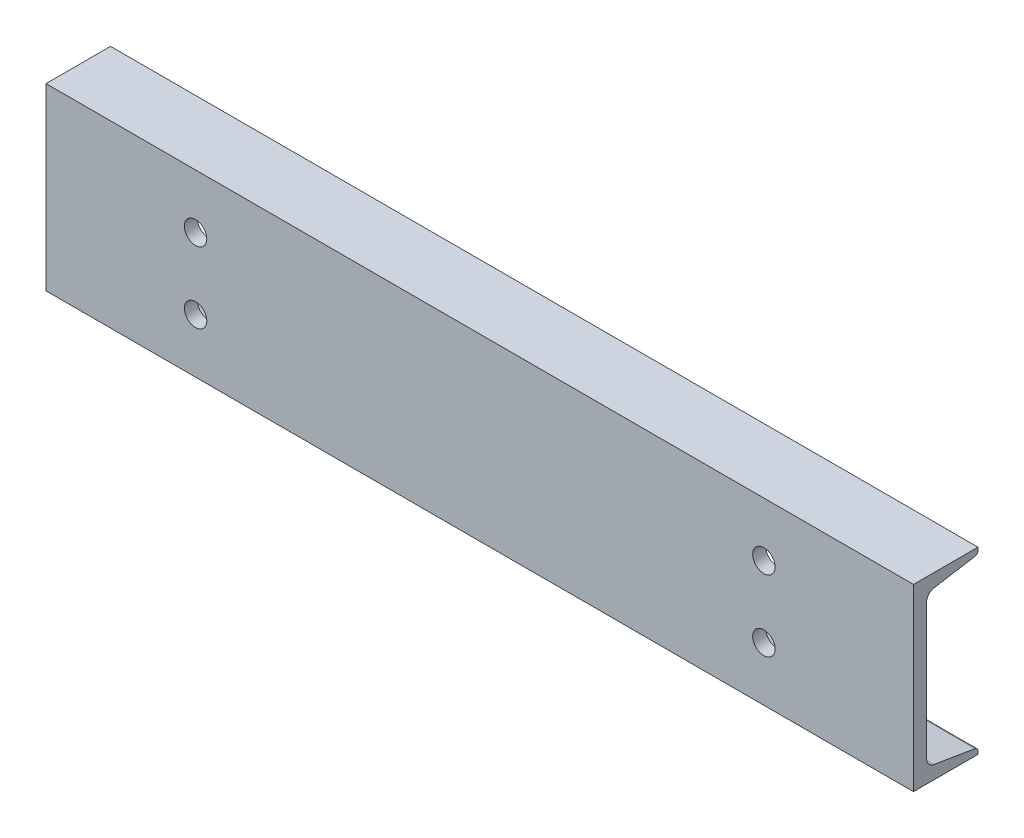
ISO-10303-21;
HEADER;
FILE_DESCRIPTION(('STEP AP214'),'2;1');
FILE_NAME('part.step','',(''),(''),'','','');
FILE_SCHEMA(('AUTOMOTIVE_DESIGN { 1 0 10303 214 1 1 1 1 }'));
ENDSEC;
DATA;
#1=APPLICATION_CONTEXT('core data for automotive mechanical design processes');
#2=APPLICATION_PROTOCOL_DEFINITION('international standard','automotive_design',2000,#1);
#3=PRODUCT_CONTEXT('',#1,'mechanical');
#4=PRODUCT('Part','Part','',(#3));
#5=PRODUCT_RELATED_PRODUCT_CATEGORY('part','',(#4));
#6=PRODUCT_DEFINITION_FORMATION('','',#4);
#7=PRODUCT_DEFINITION_CONTEXT('part definition',#1,'design');
#8=PRODUCT_DEFINITION('design','',#6,#7);
#9=PRODUCT_DEFINITION_SHAPE('','',#8);
#10=(LENGTH_UNIT() NAMED_UNIT(*) SI_UNIT(.MILLI.,.METRE.));
#11=(NAMED_UNIT(*) PLANE_ANGLE_UNIT() SI_UNIT($,.RADIAN.));
#12=(NAMED_UNIT(*) SI_UNIT($,.STERADIAN.) SOLID_ANGLE_UNIT());
#13=UNCERTAINTY_MEASURE_WITH_UNIT(LENGTH_MEASURE(1.E-05),#10,'distance_accuracy_value','');
#14=(GEOMETRIC_REPRESENTATION_CONTEXT(3) GLOBAL_UNCERTAINTY_ASSIGNED_CONTEXT((#13)) GLOBAL_UNIT_ASSIGNED_CONTEXT((#10,
#11,#12)) REPRESENTATION_CONTEXT('',''));
#15=CARTESIAN_POINT('',(0.,0.,0.));
#16=DIRECTION('',(0.,0.,1.));
#17=DIRECTION('',(1.,0.,0.));
#18=AXIS2_PLACEMENT_3D('',#15,#16,#17);
#19=CARTESIAN_POINT('',(368.3,-76.2,27.3939));
#20=DIRECTION('',(0.,1.,0.));
#21=DIRECTION('',(0.,0.,1.));
#22=AXIS2_PLACEMENT_3D('',#19,#20,#21);
#23=PLANE('',#22);
#24=CARTESIAN_POINT('',(-330.2,-76.2,-7.53109999999995));
#25=DIRECTION('',(0.,-1.,0.));
#26=DIRECTION('',(0.,0.,1.));
#27=AXIS2_PLACEMENT_3D('',#24,#25,#26);
#28=CIRCLE('',#27,9.52500000000002);
#29=CARTESIAN_POINT('',(-330.2,-76.2,1.99390000000007));
#30=VERTEX_POINT('',#29);
#31=EDGE_CURVE('E274',#30,#30,#28,.T.);
#32=ORIENTED_EDGE('',*,*,#31,.F.);
#33=EDGE_LOOP('',(#32));
#34=FACE_BOUND('',#33,.T.);
#35=CARTESIAN_POINT('',(330.2,-76.2,-7.53109999999995));
#36=DIRECTION('',(0.,-1.,0.));
#37=DIRECTION('',(0.,0.,-1.));
#38=AXIS2_PLACEMENT_3D('',#35,#36,#37);
#39=CIRCLE('',#38,9.52500000000002);
#40=CARTESIAN_POINT('',(330.2,-76.2,-17.0561));
#41=VERTEX_POINT('',#40);
#42=EDGE_CURVE('E278',#41,#41,#39,.T.);
#43=ORIENTED_EDGE('',*,*,#42,.F.);
#44=EDGE_LOOP('',(#43));
#45=FACE_BOUND('',#44,.T.);
#46=CARTESIAN_POINT('',(-190.5,-76.2,-7.53109999999995));
#47=DIRECTION('',(0.,-1.,0.));
#48=DIRECTION('',(0.,0.,1.));
#49=AXIS2_PLACEMENT_3D('',#46,#47,#48);
#50=CIRCLE('',#49,9.525);
#51=CARTESIAN_POINT('',(-190.5,-76.2,1.99390000000004));
#52=VERTEX_POINT('',#51);
#53=EDGE_CURVE('E282',#52,#52,#50,.T.);
#54=ORIENTED_EDGE('',*,*,#53,.F.);
#55=EDGE_LOOP('',(#54));
#56=FACE_BOUND('',#55,.T.);
#57=CARTESIAN_POINT('',(190.5,-76.2,-7.53109999999995));
#58=DIRECTION('',(0.,-1.,0.));
#59=DIRECTION('',(0.,0.,-1.));
#60=AXIS2_PLACEMENT_3D('',#57,#58,#59);
#61=CIRCLE('',#60,9.525);
#62=CARTESIAN_POINT('',(190.5,-76.2,-17.0560999999999));
#63=VERTEX_POINT('',#62);
#64=EDGE_CURVE('E285',#63,#63,#61,.T.);
#65=ORIENTED_EDGE('',*,*,#64,.F.);
#66=EDGE_LOOP('',(#65));
#67=FACE_BOUND('',#66,.T.);
#68=DIRECTION('',(0.,0.,-1.));
#69=VECTOR('',#68,1.);
#70=CARTESIAN_POINT('',(-368.3,-76.2,27.3939));
#71=LINE('',#70,#69);
#72=CARTESIAN_POINT('',(-368.3,-76.2,27.3939));
#73=VERTEX_POINT('',#72);
#74=CARTESIAN_POINT('',(-368.3,-76.2,-27.3939));
#75=VERTEX_POINT('',#74);
#76=EDGE_CURVE('E162',#73,#75,#71,.T.);
#77=ORIENTED_EDGE('',*,*,#76,.T.);
#78=DIRECTION('',(-1.,0.,0.));
#79=VECTOR('',#78,1.);
#80=CARTESIAN_POINT('',(368.3,-76.2,-27.3939));
#81=LINE('',#80,#79);
#82=CARTESIAN_POINT('',(368.3,-76.2,-27.3939));
#83=VERTEX_POINT('',#82);
#84=EDGE_CURVE('E11',#83,#75,#81,.T.);
#85=ORIENTED_EDGE('',*,*,#84,.F.);
#86=DIRECTION('',(0.,0.,-1.));
#87=VECTOR('',#86,1.);
#88=CARTESIAN_POINT('',(368.3,-76.2,27.3939));
#89=LINE('',#88,#87);
#90=CARTESIAN_POINT('',(368.3,-76.2,27.3939));
#91=VERTEX_POINT('',#90);
#92=EDGE_CURVE('E185',#91,#83,#89,.T.);
#93=ORIENTED_EDGE('',*,*,#92,.F.);
#94=DIRECTION('',(-1.,0.,0.));
#95=VECTOR('',#94,1.);
#96=CARTESIAN_POINT('',(368.3,-76.2,27.3939));
#97=LINE('',#96,#95);
#98=EDGE_CURVE('E158',#91,#73,#97,.T.);
#99=ORIENTED_EDGE('',*,*,#98,.T.);
#100=EDGE_LOOP('',(#77,#85,#93,#99));
#101=FACE_BOUND('',#100,.T.);
#102=ADVANCED_FACE('F42',(#34,#45,#56,#67,#101),#23,.F.);
#103=CARTESIAN_POINT('',(368.3,-76.2,-27.3939));
#104=DIRECTION('',(0.,0.,1.));
#105=DIRECTION('',(1.,0.,0.));
#106=AXIS2_PLACEMENT_3D('',#103,#104,#105);
#107=PLANE('',#106);
#108=DIRECTION('',(0.,1.,0.));
#109=VECTOR('',#108,1.);
#110=CARTESIAN_POINT('',(-368.3,-76.2,-27.3939));
#111=LINE('',#110,#109);
#112=CARTESIAN_POINT('',(-368.3,-73.7107446530364,-27.3939));
#113=VERTEX_POINT('',#112);
#114=EDGE_CURVE('E165',#75,#113,#111,.T.);
#115=ORIENTED_EDGE('',*,*,#114,.T.);
#116=DIRECTION('',(-1.,0.,0.));
#117=VECTOR('',#116,1.);
#118=CARTESIAN_POINT('',(368.3,-73.7107446530364,-27.3939));
#119=LINE('',#118,#117);
#120=CARTESIAN_POINT('',(368.3,-73.7107446530364,-27.3939));
#121=VERTEX_POINT('',#120);
#122=EDGE_CURVE('E50',#121,#113,#119,.T.);
#123=ORIENTED_EDGE('',*,*,#122,.F.);
#124=DIRECTION('',(0.,1.,0.));
#125=VECTOR('',#124,1.);
#126=CARTESIAN_POINT('',(368.3,-76.2,-27.3939));
#127=LINE('',#126,#125);
#128=EDGE_CURVE('E113',#83,#121,#127,.T.);
#129=ORIENTED_EDGE('',*,*,#128,.F.);
#130=ORIENTED_EDGE('',*,*,#84,.T.);
#131=EDGE_LOOP('',(#115,#123,#129,#130));
#132=FACE_BOUND('',#131,.T.);
#133=ADVANCED_FACE('F266',(#132),#107,.F.);
#134=CARTESIAN_POINT('',(368.3,-73.7107446530364,-24.3459));
#135=DIRECTION('',(-1.,0.,0.));
#136=DIRECTION('',(0.,0.,1.));
#137=AXIS2_PLACEMENT_3D('',#134,#135,#136);
#138=CYLINDRICAL_SURFACE('',#137,3.04799999999999);
#139=CARTESIAN_POINT('',(-368.3,-73.7107446530364,-24.3459));
#140=DIRECTION('',(1.,0.,0.));
#141=DIRECTION('',(0.,0.,-1.));
#142=AXIS2_PLACEMENT_3D('',#139,#140,#141);
#143=CIRCLE('',#142,3.04799999999999);
#144=CARTESIAN_POINT('',(-368.3,-70.7042219011292,-24.8470236796088));
#145=VERTEX_POINT('',#144);
#146=EDGE_CURVE('E168',#113,#145,#143,.T.);
#147=ORIENTED_EDGE('',*,*,#146,.T.);
#148=DIRECTION('',(-1.,0.,0.));
#149=VECTOR('',#148,1.);
#150=CARTESIAN_POINT('',(368.3,-70.7042219011292,-24.8470236796088));
#151=LINE('',#150,#149);
#152=CARTESIAN_POINT('',(368.3,-70.7042219011292,-24.8470236796088));
#153=VERTEX_POINT('',#152);
#154=EDGE_CURVE('E204',#153,#145,#151,.T.);
#155=ORIENTED_EDGE('',*,*,#154,.F.);
#156=CARTESIAN_POINT('',(368.3,-73.7107446530364,-24.3459));
#157=DIRECTION('',(1.,0.,0.));
#158=DIRECTION('',(0.,0.,-1.));
#159=AXIS2_PLACEMENT_3D('',#156,#157,#158);
#160=CIRCLE('',#159,3.04799999999999);
#161=EDGE_CURVE('E212',#121,#153,#160,.T.);
#162=ORIENTED_EDGE('',*,*,#161,.F.);
#163=ORIENTED_EDGE('',*,*,#122,.T.);
#164=EDGE_LOOP('',(#147,#155,#162,#163));
#165=FACE_BOUND('',#164,.T.);
#166=ADVANCED_FACE('F210',(#165),#138,.T.);
#167=CARTESIAN_POINT('',(368.3,-64.908143628462,9.92690919902199));
#168=DIRECTION('',(0.,-0.986391978972162,0.164410656039631));
#169=DIRECTION('',(0.,-0.164410656039631,-0.986391978972162));
#170=AXIS2_PLACEMENT_3D('',#167,#168,#169);
#171=PLANE('',#170);
#172=CARTESIAN_POINT('',(-330.2,-67.8180240885079,-7.53109999999995));
#173=DIRECTION('',(0.,-0.986391978972162,0.164410656039631));
#174=DIRECTION('',(0.,-0.164410656039631,-0.986391978972162));
#175=AXIS2_PLACEMENT_3D('',#172,#173,#174);
#176=ELLIPSE('',#175,9.65640455625485,9.52500000000002);
#177=CARTESIAN_POINT('',(-330.2,-69.4056398965859,-17.0561));
#178=VERTEX_POINT('',#177);
#179=EDGE_CURVE('E299',#178,#178,#176,.F.);
#180=ORIENTED_EDGE('',*,*,#179,.F.);
#181=EDGE_LOOP('',(#180));
#182=FACE_BOUND('',#181,.T.);
#183=CARTESIAN_POINT('',(330.2,-67.8180240885079,-7.53109999999995));
#184=DIRECTION('',(0.,-0.986391978972162,0.164410656039631));
#185=DIRECTION('',(0.,-0.164410656039631,-0.986391978972162));
#186=AXIS2_PLACEMENT_3D('',#183,#184,#185);
#187=ELLIPSE('',#186,9.65640455625485,9.52500000000002);
#188=CARTESIAN_POINT('',(330.2,-69.4056398965859,-17.0561));
#189=VERTEX_POINT('',#188);
#190=EDGE_CURVE('E296',#189,#189,#187,.F.);
#191=ORIENTED_EDGE('',*,*,#190,.F.);
#192=EDGE_LOOP('',(#191));
#193=FACE_BOUND('',#192,.T.);
#194=CARTESIAN_POINT('',(-190.5,-67.8180240885079,-7.53109999999995));
#195=DIRECTION('',(0.,-0.986391978972162,0.164410656039631));
#196=DIRECTION('',(0.,-0.164410656039631,-0.986391978972162));
#197=AXIS2_PLACEMENT_3D('',#194,#195,#196);
#198=ELLIPSE('',#197,9.65640455625482,9.525);
#199=CARTESIAN_POINT('',(-190.5,-69.4056398965858,-17.0560999999999));
#200=VERTEX_POINT('',#199);
#201=EDGE_CURVE('E287',#200,#200,#198,.F.);
#202=ORIENTED_EDGE('',*,*,#201,.F.);
#203=EDGE_LOOP('',(#202));
#204=FACE_BOUND('',#203,.T.);
#205=CARTESIAN_POINT('',(190.5,-67.8180240885079,-7.53109999999995));
#206=DIRECTION('',(0.,-0.986391978972162,0.164410656039631));
#207=DIRECTION('',(0.,-0.164410656039631,-0.986391978972162));
#208=AXIS2_PLACEMENT_3D('',#205,#206,#207);
#209=ELLIPSE('',#208,9.65640455625482,9.525);
#210=CARTESIAN_POINT('',(190.5,-69.4056398965858,-17.0560999999999));
#211=VERTEX_POINT('',#210);
#212=EDGE_CURVE('E166',#211,#211,#209,.F.);
#213=ORIENTED_EDGE('',*,*,#212,.F.);
#214=EDGE_LOOP('',(#213));
#215=FACE_BOUND('',#214,.T.);
#216=DIRECTION('',(0.,0.164410656039631,0.986391978972162));
#217=VECTOR('',#216,1.);
#218=CARTESIAN_POINT('',(-368.3,-64.908143628462,9.92690919902199));
#219=LINE('',#218,#217);
#220=CARTESIAN_POINT('',(-368.3,-64.908143628462,9.92690919902199));
#221=VERTEX_POINT('',#220);
#222=EDGE_CURVE('E170',#145,#221,#219,.T.);
#223=ORIENTED_EDGE('',*,*,#222,.T.);
#224=DIRECTION('',(-1.,0.,0.));
#225=VECTOR('',#224,1.);
#226=CARTESIAN_POINT('',(368.3,-64.908143628462,9.92690919902199));
#227=LINE('',#226,#225);
#228=CARTESIAN_POINT('',(368.3,-64.908143628462,9.92690919902199));
#229=VERTEX_POINT('',#228);
#230=EDGE_CURVE('E201',#229,#221,#227,.T.);
#231=ORIENTED_EDGE('',*,*,#230,.F.);
#232=DIRECTION('',(0.,0.164410656039631,0.986391978972162));
#233=VECTOR('',#232,1.);
#234=CARTESIAN_POINT('',(368.3,-64.908143628462,9.92690919902199));
#235=LINE('',#234,#233);
#236=EDGE_CURVE('E230',#153,#229,#235,.T.);
#237=ORIENTED_EDGE('',*,*,#236,.F.);
#238=ORIENTED_EDGE('',*,*,#154,.T.);
#239=EDGE_LOOP('',(#223,#231,#237,#238));
#240=FACE_BOUND('',#239,.T.);
#241=ADVANCED_FACE('F221',(#182,#193,#204,#215,#240),#171,.F.);
#242=CARTESIAN_POINT('',(368.3,-57.3918367486941,8.67409999999999));
#243=DIRECTION('',(-1.,0.,0.));
#244=DIRECTION('',(0.,0.,1.));
#245=AXIS2_PLACEMENT_3D('',#242,#243,#244);
#246=CYLINDRICAL_SURFACE('',#245,7.62000000000001);
#247=CARTESIAN_POINT('',(-368.3,-57.3918367486941,8.67409999999999));
#248=DIRECTION('',(-1.,0.,0.));
#249=DIRECTION('',(0.,0.,-1.));
#250=AXIS2_PLACEMENT_3D('',#247,#248,#249);
#251=CIRCLE('',#250,7.62000000000001);
#252=CARTESIAN_POINT('',(-368.3,-57.3918367486941,16.2941));
#253=VERTEX_POINT('',#252);
#254=EDGE_CURVE('E172',#221,#253,#251,.T.);
#255=ORIENTED_EDGE('',*,*,#254,.T.);
#256=DIRECTION('',(-1.,0.,0.));
#257=VECTOR('',#256,1.);
#258=CARTESIAN_POINT('',(368.3,-57.3918367486941,16.2941));
#259=LINE('',#258,#257);
#260=CARTESIAN_POINT('',(368.3,-57.3918367486941,16.2941));
#261=VERTEX_POINT('',#260);
#262=EDGE_CURVE('E198',#261,#253,#259,.T.);
#263=ORIENTED_EDGE('',*,*,#262,.F.);
#264=CARTESIAN_POINT('',(368.3,-57.3918367486941,8.67409999999999));
#265=DIRECTION('',(-1.,0.,0.));
#266=DIRECTION('',(0.,0.,-1.));
#267=AXIS2_PLACEMENT_3D('',#264,#265,#266);
#268=CIRCLE('',#267,7.62000000000001);
#269=EDGE_CURVE('E227',#229,#261,#268,.T.);
#270=ORIENTED_EDGE('',*,*,#269,.F.);
#271=ORIENTED_EDGE('',*,*,#230,.T.);
#272=EDGE_LOOP('',(#255,#263,#270,#271));
#273=FACE_BOUND('',#272,.T.);
#274=ADVANCED_FACE('F225',(#273),#246,.F.);
#275=CARTESIAN_POINT('',(368.3,57.3918367486941,16.2941));
#276=DIRECTION('',(0.,0.,1.));
#277=DIRECTION('',(0.,-1.,0.));
#278=AXIS2_PLACEMENT_3D('',#275,#276,#277);
#279=PLANE('',#278);
#280=CARTESIAN_POINT('',(241.3,30.1625,16.2941));
#281=DIRECTION('',(0.,0.,1.));
#282=DIRECTION('',(0.,-1.,0.));
#283=AXIS2_PLACEMENT_3D('',#280,#281,#282);
#284=CIRCLE('',#283,9.52500000000002);
#285=CARTESIAN_POINT('',(241.3,20.6375,16.2941));
#286=VERTEX_POINT('',#285);
#287=EDGE_CURVE('E323',#286,#286,#284,.F.);
#288=ORIENTED_EDGE('',*,*,#287,.F.);
#289=EDGE_LOOP('',(#288));
#290=FACE_BOUND('',#289,.T.);
#291=CARTESIAN_POINT('',(-241.3,30.1625000000001,16.2941));
#292=DIRECTION('',(0.,0.,1.));
#293=DIRECTION('',(0.,-1.,0.));
#294=AXIS2_PLACEMENT_3D('',#291,#292,#293);
#295=CIRCLE('',#294,9.52500000000002);
#296=CARTESIAN_POINT('',(-241.3,20.6375,16.2941));
#297=VERTEX_POINT('',#296);
#298=EDGE_CURVE('E317',#297,#297,#295,.F.);
#299=ORIENTED_EDGE('',*,*,#298,.F.);
#300=EDGE_LOOP('',(#299));
#301=FACE_BOUND('',#300,.T.);
#302=CARTESIAN_POINT('',(-241.3,-30.1625,16.2941));
#303=DIRECTION('',(0.,0.,1.));
#304=DIRECTION('',(0.,-1.,0.));
#305=AXIS2_PLACEMENT_3D('',#302,#303,#304);
#306=CIRCLE('',#305,9.52500000000002);
#307=CARTESIAN_POINT('',(-241.3,-39.6875000000001,16.2941));
#308=VERTEX_POINT('',#307);
#309=EDGE_CURVE('E311',#308,#308,#306,.F.);
#310=ORIENTED_EDGE('',*,*,#309,.F.);
#311=EDGE_LOOP('',(#310));
#312=FACE_BOUND('',#311,.T.);
#313=CARTESIAN_POINT('',(241.3,-30.1625,16.2941));
#314=DIRECTION('',(0.,0.,1.));
#315=DIRECTION('',(0.,-1.,0.));
#316=AXIS2_PLACEMENT_3D('',#313,#314,#315);
#317=CIRCLE('',#316,9.52500000000002);
#318=CARTESIAN_POINT('',(241.3,-39.6875,16.2941));
#319=VERTEX_POINT('',#318);
#320=EDGE_CURVE('E303',#319,#319,#317,.F.);
#321=ORIENTED_EDGE('',*,*,#320,.F.);
#322=EDGE_LOOP('',(#321));
#323=FACE_BOUND('',#322,.T.);
#324=DIRECTION('',(0.,1.,0.));
#325=VECTOR('',#324,1.);
#326=CARTESIAN_POINT('',(-368.3,57.3918367486941,16.2941));
#327=LINE('',#326,#325);
#328=CARTESIAN_POINT('',(-368.3,57.3918367486941,16.2941));
#329=VERTEX_POINT('',#328);
#330=EDGE_CURVE('E174',#253,#329,#327,.T.);
#331=ORIENTED_EDGE('',*,*,#330,.T.);
#332=DIRECTION('',(-1.,0.,0.));
#333=VECTOR('',#332,1.);
#334=CARTESIAN_POINT('',(368.3,57.3918367486941,16.2941));
#335=LINE('',#334,#333);
#336=CARTESIAN_POINT('',(368.3,57.3918367486941,16.2941));
#337=VERTEX_POINT('',#336);
#338=EDGE_CURVE('E195',#337,#329,#335,.T.);
#339=ORIENTED_EDGE('',*,*,#338,.F.);
#340=DIRECTION('',(0.,1.,0.));
#341=VECTOR('',#340,1.);
#342=CARTESIAN_POINT('',(368.3,57.3918367486941,16.2941));
#343=LINE('',#342,#341);
#344=EDGE_CURVE('E229',#261,#337,#343,.T.);
#345=ORIENTED_EDGE('',*,*,#344,.F.);
#346=ORIENTED_EDGE('',*,*,#262,.T.);
#347=EDGE_LOOP('',(#331,#339,#345,#346));
#348=FACE_BOUND('',#347,.T.);
#349=ADVANCED_FACE('F336',(#290,#301,#312,#323,#348),#279,.F.);
#350=CARTESIAN_POINT('',(368.3,57.3918367486941,8.6741));
#351=DIRECTION('',(-1.,0.,0.));
#352=DIRECTION('',(0.,0.,1.));
#353=AXIS2_PLACEMENT_3D('',#350,#351,#352);
#354=CYLINDRICAL_SURFACE('',#353,7.62000000000001);
#355=CARTESIAN_POINT('',(-368.3,57.3918367486941,8.6741));
#356=DIRECTION('',(-1.,0.,0.));
#357=DIRECTION('',(0.,0.,1.));
#358=AXIS2_PLACEMENT_3D('',#355,#356,#357);
#359=CIRCLE('',#358,7.62000000000001);
#360=CARTESIAN_POINT('',(-368.3,64.908143628462,9.92690919902198));
#361=VERTEX_POINT('',#360);
#362=EDGE_CURVE('E176',#329,#361,#359,.T.);
#363=ORIENTED_EDGE('',*,*,#362,.T.);
#364=DIRECTION('',(-1.,0.,0.));
#365=VECTOR('',#364,1.);
#366=CARTESIAN_POINT('',(368.3,64.908143628462,9.92690919902198));
#367=LINE('',#366,#365);
#368=CARTESIAN_POINT('',(368.3,64.908143628462,9.92690919902198));
#369=VERTEX_POINT('',#368);
#370=EDGE_CURVE('E192',#369,#361,#367,.T.);
#371=ORIENTED_EDGE('',*,*,#370,.F.);
#372=CARTESIAN_POINT('',(368.3,57.3918367486941,8.6741));
#373=DIRECTION('',(-1.,0.,0.));
#374=DIRECTION('',(0.,0.,1.));
#375=AXIS2_PLACEMENT_3D('',#372,#373,#374);
#376=CIRCLE('',#375,7.62000000000001);
#377=EDGE_CURVE('E232',#337,#369,#376,.T.);
#378=ORIENTED_EDGE('',*,*,#377,.F.);
#379=ORIENTED_EDGE('',*,*,#338,.T.);
#380=EDGE_LOOP('',(#363,#371,#378,#379));
#381=FACE_BOUND('',#380,.T.);
#382=ADVANCED_FACE('F339',(#381),#354,.F.);
#383=CARTESIAN_POINT('',(368.3,64.908143628462,9.92690919902198));
#384=DIRECTION('',(0.,0.986391978972162,0.16441065603963));
#385=DIRECTION('',(0.,-0.16441065603963,0.986391978972162));
#386=AXIS2_PLACEMENT_3D('',#383,#384,#385);
#387=PLANE('',#386);
#388=DIRECTION('',(0.,0.16441065603963,-0.986391978972162));
#389=VECTOR('',#388,1.);
#390=CARTESIAN_POINT('',(-368.3,64.908143628462,9.92690919902198));
#391=LINE('',#390,#389);
#392=CARTESIAN_POINT('',(-368.3,70.7042219011292,-24.8470236796088));
#393=VERTEX_POINT('',#392);
#394=EDGE_CURVE('E178',#361,#393,#391,.T.);
#395=ORIENTED_EDGE('',*,*,#394,.T.);
#396=DIRECTION('',(-1.,0.,0.));
#397=VECTOR('',#396,1.);
#398=CARTESIAN_POINT('',(368.3,70.7042219011292,-24.8470236796088));
#399=LINE('',#398,#397);
#400=CARTESIAN_POINT('',(368.3,70.7042219011292,-24.8470236796088));
#401=VERTEX_POINT('',#400);
#402=EDGE_CURVE('E189',#401,#393,#399,.T.);
#403=ORIENTED_EDGE('',*,*,#402,.F.);
#404=DIRECTION('',(0.,0.16441065603963,-0.986391978972162));
#405=VECTOR('',#404,1.);
#406=CARTESIAN_POINT('',(368.3,64.908143628462,9.92690919902198));
#407=LINE('',#406,#405);
#408=EDGE_CURVE('E238',#369,#401,#407,.T.);
#409=ORIENTED_EDGE('',*,*,#408,.F.);
#410=ORIENTED_EDGE('',*,*,#370,.T.);
#411=EDGE_LOOP('',(#395,#403,#409,#410));
#412=FACE_BOUND('',#411,.T.);
#413=ADVANCED_FACE('F244',(#412),#387,.F.);
#414=CARTESIAN_POINT('',(368.3,73.7107446530364,-24.3459));
#415=DIRECTION('',(-1.,0.,0.));
#416=DIRECTION('',(0.,0.,1.));
#417=AXIS2_PLACEMENT_3D('',#414,#415,#416);
#418=CYLINDRICAL_SURFACE('',#417,3.048);
#419=CARTESIAN_POINT('',(-368.3,73.7107446530364,-24.3459));
#420=DIRECTION('',(1.,0.,0.));
#421=DIRECTION('',(0.,0.,1.));
#422=AXIS2_PLACEMENT_3D('',#419,#420,#421);
#423=CIRCLE('',#422,3.048);
#424=CARTESIAN_POINT('',(-368.3,73.7107446530364,-27.3939));
#425=VERTEX_POINT('',#424);
#426=EDGE_CURVE('E180',#393,#425,#423,.T.);
#427=ORIENTED_EDGE('',*,*,#426,.T.);
#428=DIRECTION('',(-1.,0.,0.));
#429=VECTOR('',#428,1.);
#430=CARTESIAN_POINT('',(368.3,73.7107446530364,-27.3939));
#431=LINE('',#430,#429);
#432=CARTESIAN_POINT('',(368.3,73.7107446530364,-27.3939));
#433=VERTEX_POINT('',#432);
#434=EDGE_CURVE('E153',#433,#425,#431,.T.);
#435=ORIENTED_EDGE('',*,*,#434,.F.);
#436=CARTESIAN_POINT('',(368.3,73.7107446530364,-24.3459));
#437=DIRECTION('',(1.,0.,0.));
#438=DIRECTION('',(0.,0.,1.));
#439=AXIS2_PLACEMENT_3D('',#436,#437,#438);
#440=CIRCLE('',#439,3.048);
#441=EDGE_CURVE('E144',#401,#433,#440,.T.);
#442=ORIENTED_EDGE('',*,*,#441,.F.);
#443=ORIENTED_EDGE('',*,*,#402,.T.);
#444=EDGE_LOOP('',(#427,#435,#442,#443));
#445=FACE_BOUND('',#444,.T.);
#446=ADVANCED_FACE('F248',(#445),#418,.T.);
#447=CARTESIAN_POINT('',(368.3,76.2,-27.3939));
#448=DIRECTION('',(0.,0.,1.));
#449=DIRECTION('',(0.,-1.,0.));
#450=AXIS2_PLACEMENT_3D('',#447,#448,#449);
#451=PLANE('',#450);
#452=DIRECTION('',(0.,1.,0.));
#453=VECTOR('',#452,1.);
#454=CARTESIAN_POINT('',(-368.3,76.2,-27.3939));
#455=LINE('',#454,#453);
#456=CARTESIAN_POINT('',(-368.3,76.2,-27.3939));
#457=VERTEX_POINT('',#456);
#458=EDGE_CURVE('E152',#425,#457,#455,.T.);
#459=ORIENTED_EDGE('',*,*,#458,.T.);
#460=DIRECTION('',(-1.,0.,0.));
#461=VECTOR('',#460,1.);
#462=CARTESIAN_POINT('',(368.3,76.2,-27.3939));
#463=LINE('',#462,#461);
#464=CARTESIAN_POINT('',(368.3,76.2,-27.3939));
#465=VERTEX_POINT('',#464);
#466=EDGE_CURVE('E149',#465,#457,#463,.T.);
#467=ORIENTED_EDGE('',*,*,#466,.F.);
#468=DIRECTION('',(0.,1.,0.));
#469=VECTOR('',#468,1.);
#470=CARTESIAN_POINT('',(368.3,76.2,-27.3939));
#471=LINE('',#470,#469);
#472=EDGE_CURVE('E138',#433,#465,#471,.T.);
#473=ORIENTED_EDGE('',*,*,#472,.F.);
#474=ORIENTED_EDGE('',*,*,#434,.T.);
#475=EDGE_LOOP('',(#459,#467,#473,#474));
#476=FACE_BOUND('',#475,.T.);
#477=ADVANCED_FACE('F150',(#476),#451,.F.);
#478=CARTESIAN_POINT('',(368.3,76.2,27.3939));
#479=DIRECTION('',(0.,-1.,0.));
#480=DIRECTION('',(0.,0.,-1.));
#481=AXIS2_PLACEMENT_3D('',#478,#479,#480);
#482=PLANE('',#481);
#483=DIRECTION('',(0.,0.,1.));
#484=VECTOR('',#483,1.);
#485=CARTESIAN_POINT('',(-368.3,76.2,27.3939));
#486=LINE('',#485,#484);
#487=CARTESIAN_POINT('',(-368.3,76.2,27.3939));
#488=VERTEX_POINT('',#487);
#489=EDGE_CURVE('E99',#457,#488,#486,.T.);
#490=ORIENTED_EDGE('',*,*,#489,.T.);
#491=DIRECTION('',(-1.,0.,0.));
#492=VECTOR('',#491,1.);
#493=CARTESIAN_POINT('',(368.3,76.2,27.3939));
#494=LINE('',#493,#492);
#495=CARTESIAN_POINT('',(368.3,76.2,27.3939));
#496=VERTEX_POINT('',#495);
#497=EDGE_CURVE('E154',#496,#488,#494,.T.);
#498=ORIENTED_EDGE('',*,*,#497,.F.);
#499=DIRECTION('',(0.,0.,1.));
#500=VECTOR('',#499,1.);
#501=CARTESIAN_POINT('',(368.3,76.2,27.3939));
#502=LINE('',#501,#500);
#503=EDGE_CURVE('E142',#465,#496,#502,.T.);
#504=ORIENTED_EDGE('',*,*,#503,.F.);
#505=ORIENTED_EDGE('',*,*,#466,.T.);
#506=EDGE_LOOP('',(#490,#498,#504,#505));
#507=FACE_BOUND('',#506,.T.);
#508=ADVANCED_FACE('F156',(#507),#482,.F.);
#509=CARTESIAN_POINT('',(368.3,-76.2,27.3939));
#510=DIRECTION('',(0.,0.,-1.));
#511=DIRECTION('',(-1.,0.,0.));
#512=AXIS2_PLACEMENT_3D('',#509,#510,#511);
#513=PLANE('',#512);
#514=CARTESIAN_POINT('',(241.3,30.1625,27.3939));
#515=DIRECTION('',(0.,0.,1.));
#516=DIRECTION('',(-1.,0.,0.));
#517=AXIS2_PLACEMENT_3D('',#514,#515,#516);
#518=CIRCLE('',#517,9.52500000000002);
#519=CARTESIAN_POINT('',(231.775,30.1625,27.3939));
#520=VERTEX_POINT('',#519);
#521=EDGE_CURVE('E326',#520,#520,#518,.T.);
#522=ORIENTED_EDGE('',*,*,#521,.F.);
#523=EDGE_LOOP('',(#522));
#524=FACE_BOUND('',#523,.T.);
#525=CARTESIAN_POINT('',(-241.3,30.1625000000001,27.3939));
#526=DIRECTION('',(0.,0.,1.));
#527=DIRECTION('',(1.,0.,0.));
#528=AXIS2_PLACEMENT_3D('',#525,#526,#527);
#529=CIRCLE('',#528,9.52500000000002);
#530=CARTESIAN_POINT('',(-231.775,30.1625000000001,27.3939));
#531=VERTEX_POINT('',#530);
#532=EDGE_CURVE('E320',#531,#531,#529,.T.);
#533=ORIENTED_EDGE('',*,*,#532,.F.);
#534=EDGE_LOOP('',(#533));
#535=FACE_BOUND('',#534,.T.);
#536=CARTESIAN_POINT('',(-241.3,-30.1625,27.3939));
#537=DIRECTION('',(0.,0.,1.));
#538=DIRECTION('',(-1.,0.,0.));
#539=AXIS2_PLACEMENT_3D('',#536,#537,#538);
#540=CIRCLE('',#539,9.52500000000002);
#541=CARTESIAN_POINT('',(-250.825,-30.1625,27.3939));
#542=VERTEX_POINT('',#541);
#543=EDGE_CURVE('E314',#542,#542,#540,.T.);
#544=ORIENTED_EDGE('',*,*,#543,.F.);
#545=EDGE_LOOP('',(#544));
#546=FACE_BOUND('',#545,.T.);
#547=CARTESIAN_POINT('',(241.3,-30.1625,27.3939));
#548=DIRECTION('',(0.,0.,1.));
#549=DIRECTION('',(1.,0.,0.));
#550=AXIS2_PLACEMENT_3D('',#547,#548,#549);
#551=CIRCLE('',#550,9.52500000000002);
#552=CARTESIAN_POINT('',(250.825,-30.1625,27.3939));
#553=VERTEX_POINT('',#552);
#554=EDGE_CURVE('E308',#553,#553,#551,.T.);
#555=ORIENTED_EDGE('',*,*,#554,.F.);
#556=EDGE_LOOP('',(#555));
#557=FACE_BOUND('',#556,.T.);
#558=DIRECTION('',(0.,-1.,0.));
#559=VECTOR('',#558,1.);
#560=CARTESIAN_POINT('',(-368.3,-76.2,27.3939));
#561=LINE('',#560,#559);
#562=EDGE_CURVE('E105',#488,#73,#561,.T.);
#563=ORIENTED_EDGE('',*,*,#562,.T.);
#564=ORIENTED_EDGE('',*,*,#98,.F.);
#565=DIRECTION('',(0.,-1.,0.));
#566=VECTOR('',#565,1.);
#567=CARTESIAN_POINT('',(368.3,-76.2,27.3939));
#568=LINE('',#567,#566);
#569=EDGE_CURVE('E58',#496,#91,#568,.T.);
#570=ORIENTED_EDGE('',*,*,#569,.F.);
#571=ORIENTED_EDGE('',*,*,#497,.T.);
#572=EDGE_LOOP('',(#563,#564,#570,#571));
#573=FACE_BOUND('',#572,.T.);
#574=ADVANCED_FACE('F252',(#524,#535,#546,#557,#573),#513,.F.);
#575=CARTESIAN_POINT('',(368.3,-73.7107446530364,-24.3459));
#576=DIRECTION('',(1.,0.,0.));
#577=DIRECTION('',(0.,0.,-1.));
#578=AXIS2_PLACEMENT_3D('',#575,#576,#577);
#579=PLANE('',#578);
#580=ORIENTED_EDGE('',*,*,#92,.T.);
#581=ORIENTED_EDGE('',*,*,#128,.T.);
#582=ORIENTED_EDGE('',*,*,#161,.T.);
#583=ORIENTED_EDGE('',*,*,#236,.T.);
#584=ORIENTED_EDGE('',*,*,#269,.T.);
#585=ORIENTED_EDGE('',*,*,#344,.T.);
#586=ORIENTED_EDGE('',*,*,#377,.T.);
#587=ORIENTED_EDGE('',*,*,#408,.T.);
#588=ORIENTED_EDGE('',*,*,#441,.T.);
#589=ORIENTED_EDGE('',*,*,#472,.T.);
#590=ORIENTED_EDGE('',*,*,#503,.T.);
#591=ORIENTED_EDGE('',*,*,#569,.T.);
#592=EDGE_LOOP('',(#580,#581,#582,#583,#584,#585,#586,#587,#588,#589,#590,#591));
#593=FACE_BOUND('',#592,.T.);
#594=ADVANCED_FACE('F140',(#593),#579,.T.);
#595=CARTESIAN_POINT('',(-368.3,-73.7107446530364,-24.3459));
#596=DIRECTION('',(1.,0.,0.));
#597=DIRECTION('',(0.,0.,-1.));
#598=AXIS2_PLACEMENT_3D('',#595,#596,#597);
#599=PLANE('',#598);
#600=ORIENTED_EDGE('',*,*,#76,.F.);
#601=ORIENTED_EDGE('',*,*,#562,.F.);
#602=ORIENTED_EDGE('',*,*,#489,.F.);
#603=ORIENTED_EDGE('',*,*,#458,.F.);
#604=ORIENTED_EDGE('',*,*,#426,.F.);
#605=ORIENTED_EDGE('',*,*,#394,.F.);
#606=ORIENTED_EDGE('',*,*,#362,.F.);
#607=ORIENTED_EDGE('',*,*,#330,.F.);
#608=ORIENTED_EDGE('',*,*,#254,.F.);
#609=ORIENTED_EDGE('',*,*,#222,.F.);
#610=ORIENTED_EDGE('',*,*,#146,.F.);
#611=ORIENTED_EDGE('',*,*,#114,.F.);
#612=EDGE_LOOP('',(#600,#601,#602,#603,#604,#605,#606,#607,#608,#609,#610,#611));
#613=FACE_BOUND('',#612,.T.);
#614=ADVANCED_FACE('F216',(#613),#599,.F.);
#615=CARTESIAN_POINT('',(190.5,76.201,-7.53109999999995));
#616=DIRECTION('',(0.,-1.,0.));
#617=DIRECTION('',(0.,0.,-1.));
#618=AXIS2_PLACEMENT_3D('',#615,#616,#617);
#619=CYLINDRICAL_SURFACE('',#618,9.525);
#620=ORIENTED_EDGE('',*,*,#64,.T.);
#621=EDGE_LOOP('',(#620));
#622=FACE_BOUND('',#621,.T.);
#623=ORIENTED_EDGE('',*,*,#212,.T.);
#624=EDGE_LOOP('',(#623));
#625=FACE_BOUND('',#624,.T.);
#626=ADVANCED_FACE('F444',(#622,#625),#619,.F.);
#627=CARTESIAN_POINT('',(-190.5,76.201,-7.53109999999995));
#628=DIRECTION('',(0.,-1.,0.));
#629=DIRECTION('',(0.,0.,-1.));
#630=AXIS2_PLACEMENT_3D('',#627,#628,#629);
#631=CYLINDRICAL_SURFACE('',#630,9.525);
#632=ORIENTED_EDGE('',*,*,#53,.T.);
#633=EDGE_LOOP('',(#632));
#634=FACE_BOUND('',#633,.T.);
#635=ORIENTED_EDGE('',*,*,#201,.T.);
#636=EDGE_LOOP('',(#635));
#637=FACE_BOUND('',#636,.T.);
#638=ADVANCED_FACE('F440',(#634,#637),#631,.F.);
#639=CARTESIAN_POINT('',(330.2,76.201,-7.53109999999995));
#640=DIRECTION('',(0.,-1.,0.));
#641=DIRECTION('',(0.,0.,-1.));
#642=AXIS2_PLACEMENT_3D('',#639,#640,#641);
#643=CYLINDRICAL_SURFACE('',#642,9.52500000000002);
#644=ORIENTED_EDGE('',*,*,#42,.T.);
#645=EDGE_LOOP('',(#644));
#646=FACE_BOUND('',#645,.T.);
#647=ORIENTED_EDGE('',*,*,#190,.T.);
#648=EDGE_LOOP('',(#647));
#649=FACE_BOUND('',#648,.T.);
#650=ADVANCED_FACE('F436',(#646,#649),#643,.F.);
#651=CARTESIAN_POINT('',(-330.2,76.201,-7.53109999999995));
#652=DIRECTION('',(0.,-1.,0.));
#653=DIRECTION('',(0.,0.,-1.));
#654=AXIS2_PLACEMENT_3D('',#651,#652,#653);
#655=CYLINDRICAL_SURFACE('',#654,9.52500000000002);
#656=ORIENTED_EDGE('',*,*,#31,.T.);
#657=EDGE_LOOP('',(#656));
#658=FACE_BOUND('',#657,.T.);
#659=ORIENTED_EDGE('',*,*,#179,.T.);
#660=EDGE_LOOP('',(#659));
#661=FACE_BOUND('',#660,.T.);
#662=ADVANCED_FACE('F387',(#658,#661),#655,.F.);
#663=CARTESIAN_POINT('',(241.3,-30.1625,-27.3949));
#664=DIRECTION('',(0.,0.,1.));
#665=DIRECTION('',(1.,0.,0.));
#666=AXIS2_PLACEMENT_3D('',#663,#664,#665);
#667=CYLINDRICAL_SURFACE('',#666,9.52500000000002);
#668=ORIENTED_EDGE('',*,*,#554,.T.);
#669=EDGE_LOOP('',(#668));
#670=FACE_BOUND('',#669,.T.);
#671=ORIENTED_EDGE('',*,*,#320,.T.);
#672=EDGE_LOOP('',(#671));
#673=FACE_BOUND('',#672,.T.);
#674=ADVANCED_FACE('F399',(#670,#673),#667,.F.);
#675=CARTESIAN_POINT('',(-241.3,-30.1625,-27.3949));
#676=DIRECTION('',(0.,0.,1.));
#677=DIRECTION('',(1.,0.,0.));
#678=AXIS2_PLACEMENT_3D('',#675,#676,#677);
#679=CYLINDRICAL_SURFACE('',#678,9.52500000000002);
#680=ORIENTED_EDGE('',*,*,#543,.T.);
#681=EDGE_LOOP('',(#680));
#682=FACE_BOUND('',#681,.T.);
#683=ORIENTED_EDGE('',*,*,#309,.T.);
#684=EDGE_LOOP('',(#683));
#685=FACE_BOUND('',#684,.T.);
#686=ADVANCED_FACE('F404',(#682,#685),#679,.F.);
#687=CARTESIAN_POINT('',(-241.3,30.1625000000001,-27.3949));
#688=DIRECTION('',(0.,0.,1.));
#689=DIRECTION('',(1.,0.,0.));
#690=AXIS2_PLACEMENT_3D('',#687,#688,#689);
#691=CYLINDRICAL_SURFACE('',#690,9.52500000000002);
#692=ORIENTED_EDGE('',*,*,#532,.T.);
#693=EDGE_LOOP('',(#692));
#694=FACE_BOUND('',#693,.T.);
#695=ORIENTED_EDGE('',*,*,#298,.T.);
#696=EDGE_LOOP('',(#695));
#697=FACE_BOUND('',#696,.T.);
#698=ADVANCED_FACE('F332',(#694,#697),#691,.F.);
#699=CARTESIAN_POINT('',(241.3,30.1625,-27.3949));
#700=DIRECTION('',(0.,0.,1.));
#701=DIRECTION('',(1.,0.,0.));
#702=AXIS2_PLACEMENT_3D('',#699,#700,#701);
#703=CYLINDRICAL_SURFACE('',#702,9.52500000000002);
#704=ORIENTED_EDGE('',*,*,#521,.T.);
#705=EDGE_LOOP('',(#704));
#706=FACE_BOUND('',#705,.T.);
#707=ORIENTED_EDGE('',*,*,#287,.T.);
#708=EDGE_LOOP('',(#707));
#709=FACE_BOUND('',#708,.T.);
#710=ADVANCED_FACE('F329',(#706,#709),#703,.F.);
#711=CLOSED_SHELL('',(#102,#133,#166,#241,#274,#349,#382,#413,#446,#477,#508,#574,#594,#614,
#626,#638,#650,#662,#674,#686,#698,#710));
#712=MANIFOLD_SOLID_BREP('B2',#711);
#713=ADVANCED_BREP_SHAPE_REPRESENTATION('',(#18,#712),#14);
#714=SHAPE_DEFINITION_REPRESENTATION(#9,#713);
ENDSEC;
END-ISO-10303-21;
